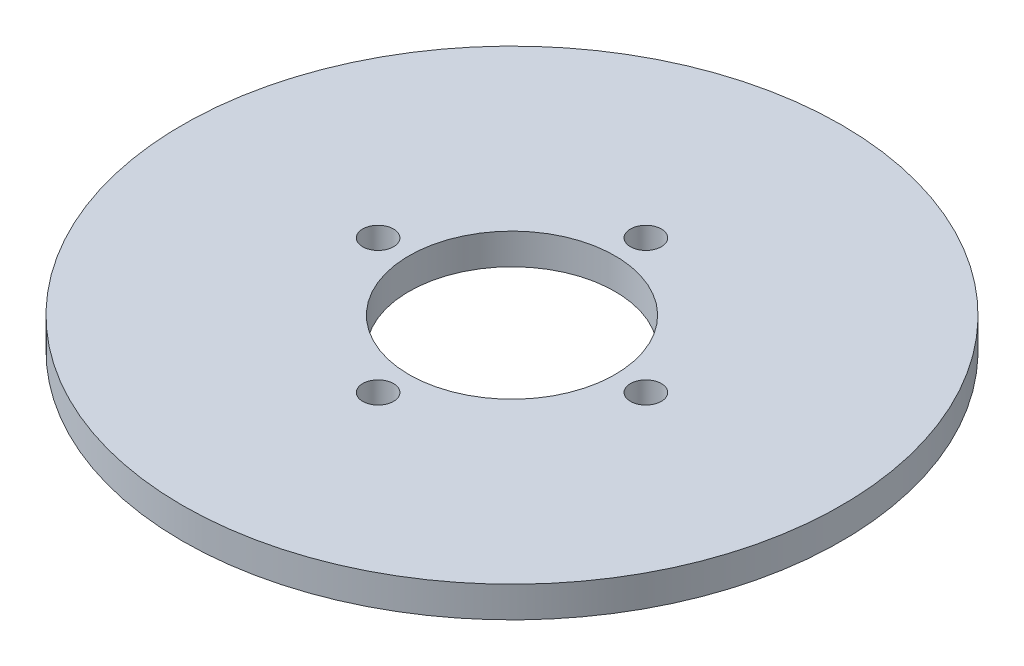
ISO-10303-21;
HEADER;
FILE_DESCRIPTION(('STEP AP214'),'2;1');
FILE_NAME('part.step','',(''),(''),'','','');
FILE_SCHEMA(('AUTOMOTIVE_DESIGN { 1 0 10303 214 1 1 1 1 }'));
ENDSEC;
DATA;
#1=APPLICATION_CONTEXT('core data for automotive mechanical design processes');
#2=APPLICATION_PROTOCOL_DEFINITION('international standard','automotive_design',2000,#1);
#3=PRODUCT_CONTEXT('',#1,'mechanical');
#4=PRODUCT('Part','Part','',(#3));
#5=PRODUCT_RELATED_PRODUCT_CATEGORY('part','',(#4));
#6=PRODUCT_DEFINITION_FORMATION('','',#4);
#7=PRODUCT_DEFINITION_CONTEXT('part definition',#1,'design');
#8=PRODUCT_DEFINITION('design','',#6,#7);
#9=PRODUCT_DEFINITION_SHAPE('','',#8);
#10=(LENGTH_UNIT() NAMED_UNIT(*) SI_UNIT(.MILLI.,.METRE.));
#11=(NAMED_UNIT(*) PLANE_ANGLE_UNIT() SI_UNIT($,.RADIAN.));
#12=(NAMED_UNIT(*) SI_UNIT($,.STERADIAN.) SOLID_ANGLE_UNIT());
#13=UNCERTAINTY_MEASURE_WITH_UNIT(LENGTH_MEASURE(1.E-05),#10,'distance_accuracy_value','');
#14=(GEOMETRIC_REPRESENTATION_CONTEXT(3) GLOBAL_UNCERTAINTY_ASSIGNED_CONTEXT((#13)) GLOBAL_UNIT_ASSIGNED_CONTEXT((#10,
#11,#12)) REPRESENTATION_CONTEXT('',''));
#15=CARTESIAN_POINT('',(0.,0.,0.));
#16=DIRECTION('',(0.,0.,1.));
#17=DIRECTION('',(1.,0.,0.));
#18=AXIS2_PLACEMENT_3D('',#15,#16,#17);
#19=CARTESIAN_POINT('',(0.,3.,0.));
#20=DIRECTION('',(0.,-1.,0.));
#21=DIRECTION('',(0.,0.,-1.));
#22=AXIS2_PLACEMENT_3D('',#19,#20,#21);
#23=CYLINDRICAL_SURFACE('',#22,32.);
#24=CARTESIAN_POINT('',(0.,3.,0.));
#25=DIRECTION('',(0.,1.,0.));
#26=DIRECTION('',(0.,0.,1.));
#27=AXIS2_PLACEMENT_3D('',#24,#25,#26);
#28=CIRCLE('',#27,32.);
#29=CARTESIAN_POINT('',(0.,3.,32.));
#30=VERTEX_POINT('',#29);
#31=EDGE_CURVE('E10',#30,#30,#28,.T.);
#32=ORIENTED_EDGE('',*,*,#31,.F.);
#33=EDGE_LOOP('',(#32));
#34=FACE_BOUND('',#33,.T.);
#35=CARTESIAN_POINT('',(0.,0.,0.));
#36=DIRECTION('',(0.,1.,0.));
#37=DIRECTION('',(0.,0.,1.));
#38=AXIS2_PLACEMENT_3D('',#35,#36,#37);
#39=CIRCLE('',#38,32.);
#40=CARTESIAN_POINT('',(0.,0.,32.));
#41=VERTEX_POINT('',#40);
#42=EDGE_CURVE('E37',#41,#41,#39,.T.);
#43=ORIENTED_EDGE('',*,*,#42,.T.);
#44=EDGE_LOOP('',(#43));
#45=FACE_BOUND('',#44,.T.);
#46=ADVANCED_FACE('F30',(#34,#45),#23,.T.);
#47=CARTESIAN_POINT('',(0.,3.,0.));
#48=DIRECTION('',(0.,1.,0.));
#49=DIRECTION('',(0.,0.,1.));
#50=AXIS2_PLACEMENT_3D('',#47,#48,#49);
#51=PLANE('',#50);
#52=CARTESIAN_POINT('',(0.,3.,-13.));
#53=DIRECTION('',(0.,-1.,0.));
#54=DIRECTION('',(0.,0.,-1.));
#55=AXIS2_PLACEMENT_3D('',#52,#53,#54);
#56=CIRCLE('',#55,1.5);
#57=CARTESIAN_POINT('',(0.,3.,-14.5));
#58=VERTEX_POINT('',#57);
#59=EDGE_CURVE('E65',#58,#58,#56,.T.);
#60=ORIENTED_EDGE('',*,*,#59,.T.);
#61=EDGE_LOOP('',(#60));
#62=FACE_BOUND('',#61,.T.);
#63=CARTESIAN_POINT('',(-13.,3.,0.));
#64=DIRECTION('',(0.,-1.,0.));
#65=DIRECTION('',(0.,0.,-1.));
#66=AXIS2_PLACEMENT_3D('',#63,#64,#65);
#67=CIRCLE('',#66,1.5);
#68=CARTESIAN_POINT('',(-13.,3.,-1.5));
#69=VERTEX_POINT('',#68);
#70=EDGE_CURVE('E59',#69,#69,#67,.T.);
#71=ORIENTED_EDGE('',*,*,#70,.T.);
#72=EDGE_LOOP('',(#71));
#73=FACE_BOUND('',#72,.T.);
#74=CARTESIAN_POINT('',(0.,3.,13.));
#75=DIRECTION('',(0.,-1.,0.));
#76=DIRECTION('',(0.,0.,-1.));
#77=AXIS2_PLACEMENT_3D('',#74,#75,#76);
#78=CIRCLE('',#77,1.5);
#79=CARTESIAN_POINT('',(0.,3.,11.5));
#80=VERTEX_POINT('',#79);
#81=EDGE_CURVE('E53',#80,#80,#78,.T.);
#82=ORIENTED_EDGE('',*,*,#81,.T.);
#83=EDGE_LOOP('',(#82));
#84=FACE_BOUND('',#83,.T.);
#85=CARTESIAN_POINT('',(13.,3.,0.));
#86=DIRECTION('',(0.,-1.,0.));
#87=DIRECTION('',(0.,0.,-1.));
#88=AXIS2_PLACEMENT_3D('',#85,#86,#87);
#89=CIRCLE('',#88,1.5);
#90=CARTESIAN_POINT('',(13.,3.,-1.5));
#91=VERTEX_POINT('',#90);
#92=EDGE_CURVE('E46',#91,#91,#89,.T.);
#93=ORIENTED_EDGE('',*,*,#92,.T.);
#94=EDGE_LOOP('',(#93));
#95=FACE_BOUND('',#94,.T.);
#96=CARTESIAN_POINT('',(0.,3.,0.));
#97=DIRECTION('',(0.,1.,0.));
#98=DIRECTION('',(0.,0.,1.));
#99=AXIS2_PLACEMENT_3D('',#96,#97,#98);
#100=CIRCLE('',#99,10.);
#101=CARTESIAN_POINT('',(0.,3.,10.));
#102=VERTEX_POINT('',#101);
#103=EDGE_CURVE('E43',#102,#102,#100,.T.);
#104=ORIENTED_EDGE('',*,*,#103,.F.);
#105=EDGE_LOOP('',(#104));
#106=FACE_BOUND('',#105,.T.);
#107=ORIENTED_EDGE('',*,*,#31,.T.);
#108=EDGE_LOOP('',(#107));
#109=FACE_BOUND('',#108,.T.);
#110=ADVANCED_FACE('F77',(#62,#73,#84,#95,#106,#109),#51,.T.);
#111=CARTESIAN_POINT('',(0.,0.,0.));
#112=DIRECTION('',(0.,1.,0.));
#113=DIRECTION('',(0.,0.,1.));
#114=AXIS2_PLACEMENT_3D('',#111,#112,#113);
#115=PLANE('',#114);
#116=CARTESIAN_POINT('',(0.,0.,-13.));
#117=DIRECTION('',(0.,-1.,0.));
#118=DIRECTION('',(0.,0.,-1.));
#119=AXIS2_PLACEMENT_3D('',#116,#117,#118);
#120=CIRCLE('',#119,1.5);
#121=CARTESIAN_POINT('',(0.,0.,-14.5));
#122=VERTEX_POINT('',#121);
#123=EDGE_CURVE('E50',#122,#122,#120,.T.);
#124=ORIENTED_EDGE('',*,*,#123,.F.);
#125=EDGE_LOOP('',(#124));
#126=FACE_BOUND('',#125,.T.);
#127=CARTESIAN_POINT('',(-13.,0.,0.));
#128=DIRECTION('',(0.,-1.,0.));
#129=DIRECTION('',(0.,0.,-1.));
#130=AXIS2_PLACEMENT_3D('',#127,#128,#129);
#131=CIRCLE('',#130,1.5);
#132=CARTESIAN_POINT('',(-13.,0.,-1.5));
#133=VERTEX_POINT('',#132);
#134=EDGE_CURVE('E62',#133,#133,#131,.T.);
#135=ORIENTED_EDGE('',*,*,#134,.F.);
#136=EDGE_LOOP('',(#135));
#137=FACE_BOUND('',#136,.T.);
#138=CARTESIAN_POINT('',(0.,0.,13.));
#139=DIRECTION('',(0.,-1.,0.));
#140=DIRECTION('',(0.,0.,-1.));
#141=AXIS2_PLACEMENT_3D('',#138,#139,#140);
#142=CIRCLE('',#141,1.5);
#143=CARTESIAN_POINT('',(0.,0.,11.5));
#144=VERTEX_POINT('',#143);
#145=EDGE_CURVE('E56',#144,#144,#142,.T.);
#146=ORIENTED_EDGE('',*,*,#145,.F.);
#147=EDGE_LOOP('',(#146));
#148=FACE_BOUND('',#147,.T.);
#149=CARTESIAN_POINT('',(13.,0.,0.));
#150=DIRECTION('',(0.,-1.,0.));
#151=DIRECTION('',(0.,0.,-1.));
#152=AXIS2_PLACEMENT_3D('',#149,#150,#151);
#153=CIRCLE('',#152,1.5);
#154=CARTESIAN_POINT('',(13.,0.,-1.5));
#155=VERTEX_POINT('',#154);
#156=EDGE_CURVE('E47',#155,#155,#153,.T.);
#157=ORIENTED_EDGE('',*,*,#156,.F.);
#158=EDGE_LOOP('',(#157));
#159=FACE_BOUND('',#158,.T.);
#160=CARTESIAN_POINT('',(0.,0.,0.));
#161=DIRECTION('',(0.,1.,0.));
#162=DIRECTION('',(0.,0.,1.));
#163=AXIS2_PLACEMENT_3D('',#160,#161,#162);
#164=CIRCLE('',#163,10.);
#165=CARTESIAN_POINT('',(0.,0.,10.));
#166=VERTEX_POINT('',#165);
#167=EDGE_CURVE('E33',#166,#166,#164,.T.);
#168=ORIENTED_EDGE('',*,*,#167,.T.);
#169=EDGE_LOOP('',(#168));
#170=FACE_BOUND('',#169,.T.);
#171=ORIENTED_EDGE('',*,*,#42,.F.);
#172=EDGE_LOOP('',(#171));
#173=FACE_BOUND('',#172,.T.);
#174=ADVANCED_FACE('F73',(#126,#137,#148,#159,#170,#173),#115,.F.);
#175=CARTESIAN_POINT('',(0.,-7.,0.));
#176=DIRECTION('',(0.,1.,0.));
#177=DIRECTION('',(0.,0.,1.));
#178=AXIS2_PLACEMENT_3D('',#175,#176,#177);
#179=CYLINDRICAL_SURFACE('',#178,10.);
#180=ORIENTED_EDGE('',*,*,#103,.T.);
#181=EDGE_LOOP('',(#180));
#182=FACE_BOUND('',#181,.T.);
#183=ORIENTED_EDGE('',*,*,#167,.F.);
#184=EDGE_LOOP('',(#183));
#185=FACE_BOUND('',#184,.T.);
#186=ADVANCED_FACE('F76',(#182,#185),#179,.F.);
#187=CARTESIAN_POINT('',(13.,3.,0.));
#188=DIRECTION('',(0.,-1.,0.));
#189=DIRECTION('',(0.,0.,-1.));
#190=AXIS2_PLACEMENT_3D('',#187,#188,#189);
#191=CYLINDRICAL_SURFACE('',#190,1.5);
#192=ORIENTED_EDGE('',*,*,#92,.F.);
#193=EDGE_LOOP('',(#192));
#194=FACE_BOUND('',#193,.T.);
#195=ORIENTED_EDGE('',*,*,#156,.T.);
#196=EDGE_LOOP('',(#195));
#197=FACE_BOUND('',#196,.T.);
#198=ADVANCED_FACE('F102',(#194,#197),#191,.F.);
#199=CARTESIAN_POINT('',(0.,3.,13.));
#200=DIRECTION('',(0.,-1.,0.));
#201=DIRECTION('',(0.,0.,-1.));
#202=AXIS2_PLACEMENT_3D('',#199,#200,#201);
#203=CYLINDRICAL_SURFACE('',#202,1.5);
#204=ORIENTED_EDGE('',*,*,#81,.F.);
#205=EDGE_LOOP('',(#204));
#206=FACE_BOUND('',#205,.T.);
#207=ORIENTED_EDGE('',*,*,#145,.T.);
#208=EDGE_LOOP('',(#207));
#209=FACE_BOUND('',#208,.T.);
#210=ADVANCED_FACE('F106',(#206,#209),#203,.F.);
#211=CARTESIAN_POINT('',(-13.,3.,0.));
#212=DIRECTION('',(0.,-1.,0.));
#213=DIRECTION('',(0.,0.,-1.));
#214=AXIS2_PLACEMENT_3D('',#211,#212,#213);
#215=CYLINDRICAL_SURFACE('',#214,1.5);
#216=ORIENTED_EDGE('',*,*,#70,.F.);
#217=EDGE_LOOP('',(#216));
#218=FACE_BOUND('',#217,.T.);
#219=ORIENTED_EDGE('',*,*,#134,.T.);
#220=EDGE_LOOP('',(#219));
#221=FACE_BOUND('',#220,.T.);
#222=ADVANCED_FACE('F110',(#218,#221),#215,.F.);
#223=CARTESIAN_POINT('',(0.,3.,-13.));
#224=DIRECTION('',(0.,-1.,0.));
#225=DIRECTION('',(0.,0.,-1.));
#226=AXIS2_PLACEMENT_3D('',#223,#224,#225);
#227=CYLINDRICAL_SURFACE('',#226,1.5);
#228=ORIENTED_EDGE('',*,*,#59,.F.);
#229=EDGE_LOOP('',(#228));
#230=FACE_BOUND('',#229,.T.);
#231=ORIENTED_EDGE('',*,*,#123,.T.);
#232=EDGE_LOOP('',(#231));
#233=FACE_BOUND('',#232,.T.);
#234=ADVANCED_FACE('F71',(#230,#233),#227,.F.);
#235=CLOSED_SHELL('',(#46,#110,#174,#186,#198,#210,#222,#234));
#236=MANIFOLD_SOLID_BREP('B2',#235);
#237=ADVANCED_BREP_SHAPE_REPRESENTATION('',(#18,#236),#14);
#238=SHAPE_DEFINITION_REPRESENTATION(#9,#237);
ENDSEC;
END-ISO-10303-21;
